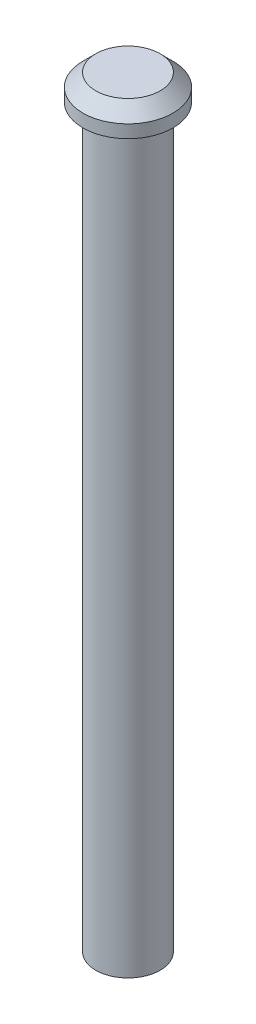
ISO-10303-21;
HEADER;
FILE_DESCRIPTION(('STEP AP214'),'2;1');
FILE_NAME('part.step','',(''),(''),'','','');
FILE_SCHEMA(('AUTOMOTIVE_DESIGN { 1 0 10303 214 1 1 1 1 }'));
ENDSEC;
DATA;
#1=APPLICATION_CONTEXT('core data for automotive mechanical design processes');
#2=APPLICATION_PROTOCOL_DEFINITION('international standard','automotive_design',2000,#1);
#3=PRODUCT_CONTEXT('',#1,'mechanical');
#4=PRODUCT('Part','Part','',(#3));
#5=PRODUCT_RELATED_PRODUCT_CATEGORY('part','',(#4));
#6=PRODUCT_DEFINITION_FORMATION('','',#4);
#7=PRODUCT_DEFINITION_CONTEXT('part definition',#1,'design');
#8=PRODUCT_DEFINITION('design','',#6,#7);
#9=PRODUCT_DEFINITION_SHAPE('','',#8);
#10=(LENGTH_UNIT() NAMED_UNIT(*) SI_UNIT(.MILLI.,.METRE.));
#11=(NAMED_UNIT(*) PLANE_ANGLE_UNIT() SI_UNIT($,.RADIAN.));
#12=(NAMED_UNIT(*) SI_UNIT($,.STERADIAN.) SOLID_ANGLE_UNIT());
#13=UNCERTAINTY_MEASURE_WITH_UNIT(LENGTH_MEASURE(1.E-05),#10,'distance_accuracy_value','');
#14=(GEOMETRIC_REPRESENTATION_CONTEXT(3) GLOBAL_UNCERTAINTY_ASSIGNED_CONTEXT((#13)) GLOBAL_UNIT_ASSIGNED_CONTEXT((#10,
#11,#12)) REPRESENTATION_CONTEXT('',''));
#15=CARTESIAN_POINT('',(0.,0.,0.));
#16=DIRECTION('',(0.,0.,1.));
#17=DIRECTION('',(1.,0.,0.));
#18=AXIS2_PLACEMENT_3D('',#15,#16,#17);
#19=CARTESIAN_POINT('',(0.,57.2,0.));
#20=DIRECTION('',(0.,-1.,0.));
#21=DIRECTION('',(0.,0.,-1.));
#22=AXIS2_PLACEMENT_3D('',#19,#20,#21);
#23=CYLINDRICAL_SURFACE('',#22,2.5);
#24=CARTESIAN_POINT('',(0.,57.2,0.));
#25=DIRECTION('',(0.,1.,0.));
#26=DIRECTION('',(0.,0.,1.));
#27=AXIS2_PLACEMENT_3D('',#24,#25,#26);
#28=CIRCLE('',#27,2.5);
#29=CARTESIAN_POINT('',(0.,57.2,2.5));
#30=VERTEX_POINT('',#29);
#31=EDGE_CURVE('E52',#30,#30,#28,.T.);
#32=ORIENTED_EDGE('',*,*,#31,.F.);
#33=EDGE_LOOP('',(#32));
#34=FACE_BOUND('',#33,.T.);
#35=CARTESIAN_POINT('',(0.,0.,0.));
#36=DIRECTION('',(0.,1.,0.));
#37=DIRECTION('',(0.,0.,1.));
#38=AXIS2_PLACEMENT_3D('',#35,#36,#37);
#39=CIRCLE('',#38,2.5);
#40=CARTESIAN_POINT('',(0.,0.,2.5));
#41=VERTEX_POINT('',#40);
#42=EDGE_CURVE('E57',#41,#41,#39,.T.);
#43=ORIENTED_EDGE('',*,*,#42,.T.);
#44=EDGE_LOOP('',(#43));
#45=FACE_BOUND('',#44,.T.);
#46=ADVANCED_FACE('F38',(#34,#45),#23,.T.);
#47=CARTESIAN_POINT('',(0.,0.,0.));
#48=DIRECTION('',(0.,1.,0.));
#49=DIRECTION('',(0.,0.,1.));
#50=AXIS2_PLACEMENT_3D('',#47,#48,#49);
#51=PLANE('',#50);
#52=CARTESIAN_POINT('',(0.,0.,0.));
#53=DIRECTION('',(0.,-1.,0.));
#54=DIRECTION('',(0.,0.,-1.));
#55=AXIS2_PLACEMENT_3D('',#52,#53,#54);
#56=CIRCLE('',#55,1.5);
#57=CARTESIAN_POINT('',(0.,0.,-1.5));
#58=VERTEX_POINT('',#57);
#59=EDGE_CURVE('E68',#58,#58,#56,.T.);
#60=ORIENTED_EDGE('',*,*,#59,.F.);
#61=EDGE_LOOP('',(#60));
#62=FACE_BOUND('',#61,.T.);
#63=ORIENTED_EDGE('',*,*,#42,.F.);
#64=EDGE_LOOP('',(#63));
#65=FACE_BOUND('',#64,.T.);
#66=ADVANCED_FACE('F84',(#62,#65),#51,.F.);
#67=CARTESIAN_POINT('',(0.,59.2,0.));
#68=DIRECTION('',(0.,-1.,0.));
#69=DIRECTION('',(0.,0.,-1.));
#70=AXIS2_PLACEMENT_3D('',#67,#68,#69);
#71=CYLINDRICAL_SURFACE('',#70,3.5);
#72=CARTESIAN_POINT('',(0.,58.2,0.));
#73=DIRECTION('',(0.,1.,0.));
#74=DIRECTION('',(0.,0.,1.));
#75=AXIS2_PLACEMENT_3D('',#72,#73,#74);
#76=CIRCLE('',#75,3.5);
#77=CARTESIAN_POINT('',(0.,58.2,3.5));
#78=VERTEX_POINT('',#77);
#79=EDGE_CURVE('E10',#78,#78,#76,.F.);
#80=ORIENTED_EDGE('',*,*,#79,.T.);
#81=EDGE_LOOP('',(#80));
#82=FACE_BOUND('',#81,.T.);
#83=CARTESIAN_POINT('',(0.,57.2,0.));
#84=DIRECTION('',(0.,1.,0.));
#85=DIRECTION('',(0.,0.,1.));
#86=AXIS2_PLACEMENT_3D('',#83,#84,#85);
#87=CIRCLE('',#86,3.5);
#88=CARTESIAN_POINT('',(0.,57.2,3.5));
#89=VERTEX_POINT('',#88);
#90=EDGE_CURVE('E62',#89,#89,#87,.T.);
#91=ORIENTED_EDGE('',*,*,#90,.T.);
#92=EDGE_LOOP('',(#91));
#93=FACE_BOUND('',#92,.T.);
#94=ADVANCED_FACE('F87',(#82,#93),#71,.T.);
#95=CARTESIAN_POINT('',(0.,59.2,0.));
#96=DIRECTION('',(0.,1.,0.));
#97=DIRECTION('',(0.,0.,1.));
#98=AXIS2_PLACEMENT_3D('',#95,#96,#97);
#99=PLANE('',#98);
#100=CARTESIAN_POINT('',(0.,59.2,0.));
#101=DIRECTION('',(0.,1.,0.));
#102=DIRECTION('',(0.,0.,1.));
#103=AXIS2_PLACEMENT_3D('',#100,#101,#102);
#104=CIRCLE('',#103,2.5);
#105=CARTESIAN_POINT('',(0.,59.2,2.5));
#106=VERTEX_POINT('',#105);
#107=EDGE_CURVE('E47',#106,#106,#104,.T.);
#108=ORIENTED_EDGE('',*,*,#107,.T.);
#109=EDGE_LOOP('',(#108));
#110=FACE_BOUND('',#109,.T.);
#111=ADVANCED_FACE('F100',(#110),#99,.T.);
#112=CARTESIAN_POINT('',(0.,57.2,0.));
#113=DIRECTION('',(0.,1.,0.));
#114=DIRECTION('',(0.,0.,1.));
#115=AXIS2_PLACEMENT_3D('',#112,#113,#114);
#116=PLANE('',#115);
#117=ORIENTED_EDGE('',*,*,#31,.T.);
#118=EDGE_LOOP('',(#117));
#119=FACE_BOUND('',#118,.T.);
#120=ORIENTED_EDGE('',*,*,#90,.F.);
#121=EDGE_LOOP('',(#120));
#122=FACE_BOUND('',#121,.T.);
#123=ADVANCED_FACE('F101',(#119,#122),#116,.F.);
#124=CARTESIAN_POINT('',(0.,59.2,0.));
#125=DIRECTION('',(0.,-1.,0.));
#126=DIRECTION('',(0.,0.,-1.));
#127=AXIS2_PLACEMENT_3D('',#124,#125,#126);
#128=CONICAL_SURFACE('',#127,2.5,0.785398163397451);
#129=ORIENTED_EDGE('',*,*,#79,.F.);
#130=EDGE_LOOP('',(#129));
#131=FACE_BOUND('',#130,.T.);
#132=ORIENTED_EDGE('',*,*,#107,.F.);
#133=EDGE_LOOP('',(#132));
#134=FACE_BOUND('',#133,.T.);
#135=ADVANCED_FACE('F41',(#131,#134),#128,.T.);
#136=CARTESIAN_POINT('',(0.,5.,0.));
#137=DIRECTION('',(0.,-1.,0.));
#138=DIRECTION('',(0.,0.,-1.));
#139=AXIS2_PLACEMENT_3D('',#136,#137,#138);
#140=CYLINDRICAL_SURFACE('',#139,1.5);
#141=CARTESIAN_POINT('',(0.,5.,0.));
#142=DIRECTION('',(0.,-1.,0.));
#143=DIRECTION('',(0.,0.,-1.));
#144=AXIS2_PLACEMENT_3D('',#141,#142,#143);
#145=CIRCLE('',#144,1.5);
#146=CARTESIAN_POINT('',(0.,5.,-1.5));
#147=VERTEX_POINT('',#146);
#148=EDGE_CURVE('E67',#147,#147,#145,.T.);
#149=ORIENTED_EDGE('',*,*,#148,.F.);
#150=EDGE_LOOP('',(#149));
#151=FACE_BOUND('',#150,.T.);
#152=ORIENTED_EDGE('',*,*,#59,.T.);
#153=EDGE_LOOP('',(#152));
#154=FACE_BOUND('',#153,.T.);
#155=ADVANCED_FACE('F78',(#151,#154),#140,.F.);
#156=CARTESIAN_POINT('',(0.,5.,0.));
#157=DIRECTION('',(0.,-1.,0.));
#158=DIRECTION('',(0.,0.,-1.));
#159=AXIS2_PLACEMENT_3D('',#156,#157,#158);
#160=PLANE('',#159);
#161=ORIENTED_EDGE('',*,*,#148,.T.);
#162=EDGE_LOOP('',(#161));
#163=FACE_BOUND('',#162,.T.);
#164=ADVANCED_FACE('F76',(#163),#160,.T.);
#165=CLOSED_SHELL('',(#46,#66,#94,#111,#123,#135,#155,#164));
#166=MANIFOLD_SOLID_BREP('B2',#165);
#167=ADVANCED_BREP_SHAPE_REPRESENTATION('',(#18,#166),#14);
#168=SHAPE_DEFINITION_REPRESENTATION(#9,#167);
ENDSEC;
END-ISO-10303-21;
